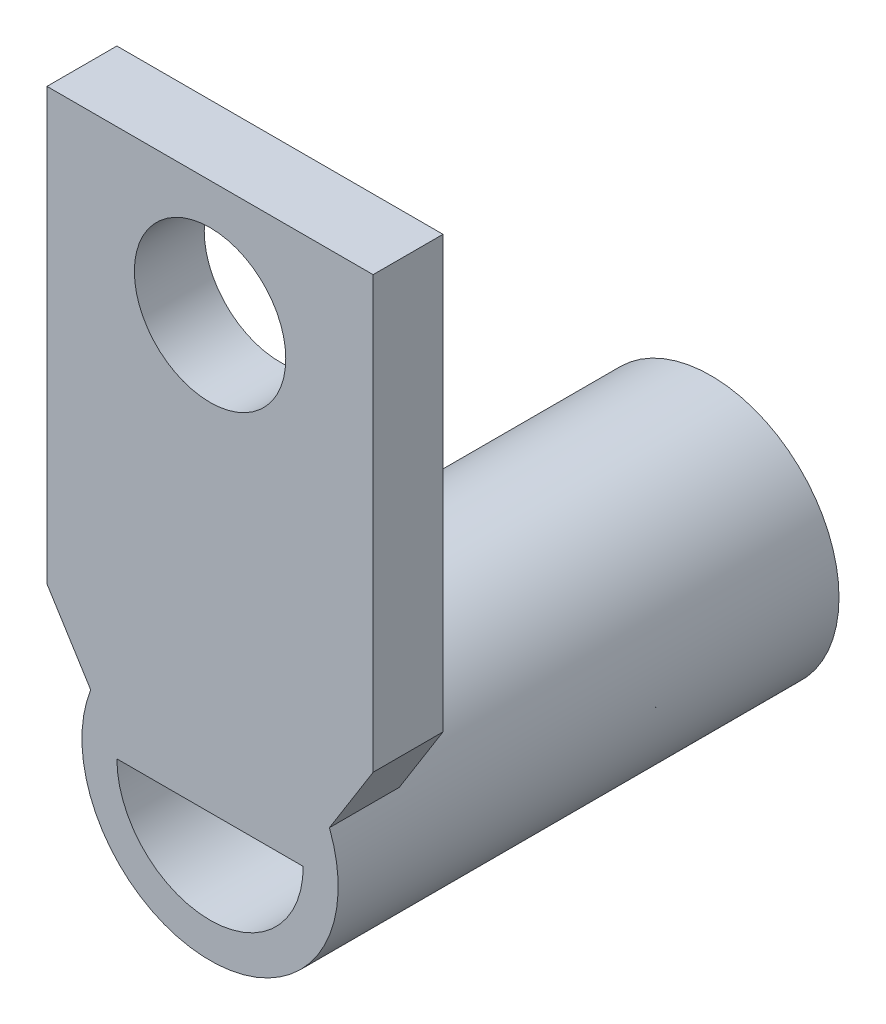
ISO-10303-21;
HEADER;
FILE_DESCRIPTION(('STEP AP214'),'2;1');
FILE_NAME('part.step','',(''),(''),'','','');
FILE_SCHEMA(('AUTOMOTIVE_DESIGN { 1 0 10303 214 1 1 1 1 }'));
ENDSEC;
DATA;
#1=APPLICATION_CONTEXT('core data for automotive mechanical design processes');
#2=APPLICATION_PROTOCOL_DEFINITION('international standard','automotive_design',2000,#1);
#3=PRODUCT_CONTEXT('',#1,'mechanical');
#4=PRODUCT('Part','Part','',(#3));
#5=PRODUCT_RELATED_PRODUCT_CATEGORY('part','',(#4));
#6=PRODUCT_DEFINITION_FORMATION('','',#4);
#7=PRODUCT_DEFINITION_CONTEXT('part definition',#1,'design');
#8=PRODUCT_DEFINITION('design','',#6,#7);
#9=PRODUCT_DEFINITION_SHAPE('','',#8);
#10=(LENGTH_UNIT() NAMED_UNIT(*) SI_UNIT(.MILLI.,.METRE.));
#11=(NAMED_UNIT(*) PLANE_ANGLE_UNIT() SI_UNIT($,.RADIAN.));
#12=(NAMED_UNIT(*) SI_UNIT($,.STERADIAN.) SOLID_ANGLE_UNIT());
#13=UNCERTAINTY_MEASURE_WITH_UNIT(LENGTH_MEASURE(1.E-05),#10,'distance_accuracy_value','');
#14=(GEOMETRIC_REPRESENTATION_CONTEXT(3) GLOBAL_UNCERTAINTY_ASSIGNED_CONTEXT((#13)) GLOBAL_UNIT_ASSIGNED_CONTEXT((#10,
#11,#12)) REPRESENTATION_CONTEXT('',''));
#15=CARTESIAN_POINT('',(0.,0.,0.));
#16=DIRECTION('',(0.,0.,1.));
#17=DIRECTION('',(1.,0.,0.));
#18=AXIS2_PLACEMENT_3D('',#15,#16,#17);
#19=CARTESIAN_POINT('',(0.,0.,21.5));
#20=DIRECTION('',(0.,0.,1.));
#21=DIRECTION('',(1.,0.,0.));
#22=AXIS2_PLACEMENT_3D('',#19,#20,#21);
#23=PLANE('',#22);
#24=DIRECTION('',(1.,0.,0.));
#25=VECTOR('',#24,1.);
#26=CARTESIAN_POINT('',(-7.,0.,21.5));
#27=LINE('',#26,#25);
#28=CARTESIAN_POINT('',(-3.99999999999999,0.,21.5));
#29=VERTEX_POINT('',#28);
#30=CARTESIAN_POINT('',(3.99999999999999,0.,21.5));
#31=VERTEX_POINT('',#30);
#32=EDGE_CURVE('E63',#29,#31,#27,.T.);
#33=ORIENTED_EDGE('',*,*,#32,.T.);
#34=CARTESIAN_POINT('',(0.,0.,21.5));
#35=DIRECTION('',(0.,0.,1.));
#36=DIRECTION('',(1.,0.,0.));
#37=AXIS2_PLACEMENT_3D('',#34,#35,#36);
#38=CIRCLE('',#37,3.99999999999999);
#39=EDGE_CURVE('E145',#29,#31,#38,.T.);
#40=ORIENTED_EDGE('',*,*,#39,.F.);
#41=EDGE_LOOP('',(#33,#40));
#42=FACE_BOUND('',#41,.T.);
#43=CARTESIAN_POINT('',(0.,0.,21.5));
#44=DIRECTION('',(0.,0.,1.));
#45=DIRECTION('',(1.,0.,0.));
#46=AXIS2_PLACEMENT_3D('',#43,#44,#45);
#47=CIRCLE('',#46,5.50000000000002);
#48=CARTESIAN_POINT('',(-5.12347538297982,2.,21.5));
#49=VERTEX_POINT('',#48);
#50=CARTESIAN_POINT('',(5.12347538297982,2.,21.5));
#51=VERTEX_POINT('',#50);
#52=EDGE_CURVE('E151',#49,#51,#47,.T.);
#53=ORIENTED_EDGE('',*,*,#52,.T.);
#54=DIRECTION('',(0.530308735896908,0.847804602860484,0.));
#55=VECTOR('',#54,1.);
#56=CARTESIAN_POINT('',(2.78341757626735,-1.74105053377078,21.5));
#57=LINE('',#56,#55);
#58=CARTESIAN_POINT('',(7.,5.,21.5));
#59=VERTEX_POINT('',#58);
#60=EDGE_CURVE('E179',#51,#59,#57,.T.);
#61=ORIENTED_EDGE('',*,*,#60,.T.);
#62=DIRECTION('',(0.,-1.,0.));
#63=VECTOR('',#62,1.);
#64=CARTESIAN_POINT('',(7.,23.5,21.5));
#65=LINE('',#64,#63);
#66=CARTESIAN_POINT('',(7.,23.5,21.5));
#67=VERTEX_POINT('',#66);
#68=EDGE_CURVE('E127',#67,#59,#65,.T.);
#69=ORIENTED_EDGE('',*,*,#68,.F.);
#70=DIRECTION('',(1.,0.,0.));
#71=VECTOR('',#70,1.);
#72=CARTESIAN_POINT('',(-7.,23.5,21.5));
#73=LINE('',#72,#71);
#74=CARTESIAN_POINT('',(-7.,23.5,21.5));
#75=VERTEX_POINT('',#74);
#76=EDGE_CURVE('E168',#75,#67,#73,.T.);
#77=ORIENTED_EDGE('',*,*,#76,.F.);
#78=DIRECTION('',(0.,-1.,0.));
#79=VECTOR('',#78,1.);
#80=CARTESIAN_POINT('',(-7.,23.5,21.5));
#81=LINE('',#80,#79);
#82=CARTESIAN_POINT('',(-7.,5.,21.5));
#83=VERTEX_POINT('',#82);
#84=EDGE_CURVE('E134',#75,#83,#81,.T.);
#85=ORIENTED_EDGE('',*,*,#84,.T.);
#86=DIRECTION('',(0.530308735896909,-0.847804602860484,0.));
#87=VECTOR('',#86,1.);
#88=CARTESIAN_POINT('',(-2.78341757626734,-1.74105053377078,21.5));
#89=LINE('',#88,#87);
#90=EDGE_CURVE('E181',#83,#49,#89,.T.);
#91=ORIENTED_EDGE('',*,*,#90,.T.);
#92=EDGE_LOOP('',(#53,#61,#69,#77,#85,#91));
#93=FACE_BOUND('',#92,.T.);
#94=CARTESIAN_POINT('',(0.,18.5,21.5));
#95=DIRECTION('',(0.,0.,1.));
#96=DIRECTION('',(1.,0.,0.));
#97=AXIS2_PLACEMENT_3D('',#94,#95,#96);
#98=CIRCLE('',#97,3.25);
#99=CARTESIAN_POINT('',(3.25,18.5,21.5));
#100=VERTEX_POINT('',#99);
#101=EDGE_CURVE('E170',#100,#100,#98,.T.);
#102=ORIENTED_EDGE('',*,*,#101,.F.);
#103=EDGE_LOOP('',(#102));
#104=FACE_BOUND('',#103,.T.);
#105=ADVANCED_FACE('F40',(#42,#93,#104),#23,.T.);
#106=CARTESIAN_POINT('',(-7.,23.5,18.5));
#107=DIRECTION('',(1.,0.,0.));
#108=DIRECTION('',(0.,0.,-1.));
#109=AXIS2_PLACEMENT_3D('',#106,#107,#108);
#110=PLANE('',#109);
#111=DIRECTION('',(0.,0.,-1.));
#112=VECTOR('',#111,1.);
#113=CARTESIAN_POINT('',(-7.,5.,28.5));
#114=LINE('',#113,#112);
#115=CARTESIAN_POINT('',(-7.,5.,18.5));
#116=VERTEX_POINT('',#115);
#117=EDGE_CURVE('E117',#83,#116,#114,.T.);
#118=ORIENTED_EDGE('',*,*,#117,.F.);
#119=ORIENTED_EDGE('',*,*,#84,.F.);
#120=DIRECTION('',(0.,0.,1.));
#121=VECTOR('',#120,1.);
#122=CARTESIAN_POINT('',(-7.,23.5,18.5));
#123=LINE('',#122,#121);
#124=CARTESIAN_POINT('',(-7.,23.5,18.5));
#125=VERTEX_POINT('',#124);
#126=EDGE_CURVE('E166',#125,#75,#123,.T.);
#127=ORIENTED_EDGE('',*,*,#126,.F.);
#128=DIRECTION('',(0.,-1.,0.));
#129=VECTOR('',#128,1.);
#130=CARTESIAN_POINT('',(-7.,23.5,18.5));
#131=LINE('',#130,#129);
#132=EDGE_CURVE('E132',#125,#116,#131,.T.);
#133=ORIENTED_EDGE('',*,*,#132,.T.);
#134=EDGE_LOOP('',(#118,#119,#127,#133));
#135=FACE_BOUND('',#134,.T.);
#136=ADVANCED_FACE('F202',(#135),#110,.F.);
#137=CARTESIAN_POINT('',(7.,23.5,18.5));
#138=DIRECTION('',(-1.,0.,0.));
#139=DIRECTION('',(0.,0.,1.));
#140=AXIS2_PLACEMENT_3D('',#137,#138,#139);
#141=PLANE('',#140);
#142=DIRECTION('',(0.,0.,-1.));
#143=VECTOR('',#142,1.);
#144=CARTESIAN_POINT('',(7.,5.,28.5));
#145=LINE('',#144,#143);
#146=CARTESIAN_POINT('',(7.,5.,18.5));
#147=VERTEX_POINT('',#146);
#148=EDGE_CURVE('E109',#59,#147,#145,.T.);
#149=ORIENTED_EDGE('',*,*,#148,.T.);
#150=DIRECTION('',(0.,-1.,0.));
#151=VECTOR('',#150,1.);
#152=CARTESIAN_POINT('',(7.,23.5,18.5));
#153=LINE('',#152,#151);
#154=CARTESIAN_POINT('',(7.,23.5,18.5));
#155=VERTEX_POINT('',#154);
#156=EDGE_CURVE('E124',#155,#147,#153,.T.);
#157=ORIENTED_EDGE('',*,*,#156,.F.);
#158=DIRECTION('',(0.,0.,-1.));
#159=VECTOR('',#158,1.);
#160=CARTESIAN_POINT('',(7.,23.5,18.5));
#161=LINE('',#160,#159);
#162=EDGE_CURVE('E174',#67,#155,#161,.T.);
#163=ORIENTED_EDGE('',*,*,#162,.F.);
#164=ORIENTED_EDGE('',*,*,#68,.T.);
#165=EDGE_LOOP('',(#149,#157,#163,#164));
#166=FACE_BOUND('',#165,.T.);
#167=ADVANCED_FACE('F122',(#166),#141,.F.);
#168=CARTESIAN_POINT('',(-7.,23.5,18.5));
#169=DIRECTION('',(0.,0.,1.));
#170=DIRECTION('',(1.,0.,0.));
#171=AXIS2_PLACEMENT_3D('',#168,#169,#170);
#172=PLANE('',#171);
#173=CARTESIAN_POINT('',(0.,18.5,18.5));
#174=DIRECTION('',(0.,0.,-1.));
#175=DIRECTION('',(-1.,0.,0.));
#176=AXIS2_PLACEMENT_3D('',#173,#174,#175);
#177=CIRCLE('',#176,3.25);
#178=CARTESIAN_POINT('',(-3.25,18.5,18.5));
#179=VERTEX_POINT('',#178);
#180=EDGE_CURVE('E184',#179,#179,#177,.T.);
#181=ORIENTED_EDGE('',*,*,#180,.F.);
#182=EDGE_LOOP('',(#181));
#183=FACE_BOUND('',#182,.T.);
#184=DIRECTION('',(-0.530308735896908,-0.847804602860484,0.));
#185=VECTOR('',#184,1.);
#186=CARTESIAN_POINT('',(2.78341757626735,-1.74105053377078,18.5));
#187=LINE('',#186,#185);
#188=CARTESIAN_POINT('',(5.12347538297982,2.,18.5));
#189=VERTEX_POINT('',#188);
#190=EDGE_CURVE('E105',#147,#189,#187,.T.);
#191=ORIENTED_EDGE('',*,*,#190,.T.);
#192=CARTESIAN_POINT('',(0.,0.,18.5));
#193=DIRECTION('',(0.,0.,1.));
#194=DIRECTION('',(1.,0.,0.));
#195=AXIS2_PLACEMENT_3D('',#192,#193,#194);
#196=CIRCLE('',#195,5.50000000000002);
#197=CARTESIAN_POINT('',(-5.12347538297982,2.,18.5));
#198=VERTEX_POINT('',#197);
#199=EDGE_CURVE('E142',#189,#198,#196,.T.);
#200=ORIENTED_EDGE('',*,*,#199,.T.);
#201=DIRECTION('',(-0.530308735896909,0.847804602860484,0.));
#202=VECTOR('',#201,1.);
#203=CARTESIAN_POINT('',(-2.78341757626734,-1.74105053377078,18.5));
#204=LINE('',#203,#202);
#205=EDGE_CURVE('E55',#198,#116,#204,.T.);
#206=ORIENTED_EDGE('',*,*,#205,.T.);
#207=ORIENTED_EDGE('',*,*,#132,.F.);
#208=DIRECTION('',(-1.,0.,0.));
#209=VECTOR('',#208,1.);
#210=CARTESIAN_POINT('',(-7.,23.5,18.5));
#211=LINE('',#210,#209);
#212=EDGE_CURVE('E131',#155,#125,#211,.T.);
#213=ORIENTED_EDGE('',*,*,#212,.F.);
#214=ORIENTED_EDGE('',*,*,#156,.T.);
#215=EDGE_LOOP('',(#191,#200,#206,#207,#213,#214));
#216=FACE_BOUND('',#215,.T.);
#217=ADVANCED_FACE('F129',(#183,#216),#172,.F.);
#218=CARTESIAN_POINT('',(0.,0.,21.5));
#219=DIRECTION('',(0.,0.,-1.));
#220=DIRECTION('',(-1.,0.,0.));
#221=AXIS2_PLACEMENT_3D('',#218,#219,#220);
#222=CYLINDRICAL_SURFACE('',#221,5.50000000000002);
#223=ORIENTED_EDGE('',*,*,#52,.F.);
#224=DIRECTION('',(0.,0.,-1.));
#225=VECTOR('',#224,1.);
#226=CARTESIAN_POINT('',(-5.12347538297982,2.,28.5));
#227=LINE('',#226,#225);
#228=EDGE_CURVE('E185',#49,#198,#227,.T.);
#229=ORIENTED_EDGE('',*,*,#228,.T.);
#230=ORIENTED_EDGE('',*,*,#199,.F.);
#231=DIRECTION('',(0.,0.,-1.));
#232=VECTOR('',#231,1.);
#233=CARTESIAN_POINT('',(5.12347538297982,2.,28.5));
#234=LINE('',#233,#232);
#235=EDGE_CURVE('E112',#51,#189,#234,.T.);
#236=ORIENTED_EDGE('',*,*,#235,.F.);
#237=EDGE_LOOP('',(#223,#229,#230,#236));
#238=FACE_BOUND('',#237,.T.);
#239=CARTESIAN_POINT('',(0.,0.,0.));
#240=DIRECTION('',(0.,0.,1.));
#241=DIRECTION('',(1.,0.,0.));
#242=AXIS2_PLACEMENT_3D('',#239,#240,#241);
#243=CIRCLE('',#242,5.50000000000002);
#244=CARTESIAN_POINT('',(5.50000000000002,0.,0.));
#245=VERTEX_POINT('',#244);
#246=EDGE_CURVE('E148',#245,#245,#243,.T.);
#247=ORIENTED_EDGE('',*,*,#246,.T.);
#248=EDGE_LOOP('',(#247));
#249=FACE_BOUND('',#248,.T.);
#250=ADVANCED_FACE('F42',(#238,#249),#222,.T.);
#251=CARTESIAN_POINT('',(0.,0.,21.5));
#252=DIRECTION('',(0.,0.,-1.));
#253=DIRECTION('',(-1.,0.,0.));
#254=AXIS2_PLACEMENT_3D('',#251,#252,#253);
#255=CYLINDRICAL_SURFACE('',#254,3.99999999999999);
#256=CARTESIAN_POINT('',(0.,0.,0.));
#257=DIRECTION('',(0.,0.,1.));
#258=DIRECTION('',(1.,0.,0.));
#259=AXIS2_PLACEMENT_3D('',#256,#257,#258);
#260=CIRCLE('',#259,3.99999999999999);
#261=CARTESIAN_POINT('',(3.99999999999999,0.,0.));
#262=VERTEX_POINT('',#261);
#263=EDGE_CURVE('E144',#262,#262,#260,.T.);
#264=ORIENTED_EDGE('',*,*,#263,.F.);
#265=EDGE_LOOP('',(#264));
#266=FACE_BOUND('',#265,.T.);
#267=ORIENTED_EDGE('',*,*,#39,.T.);
#268=DIRECTION('',(0.,0.,-1.));
#269=VECTOR('',#268,1.);
#270=CARTESIAN_POINT('',(3.99999999999999,0.,21.5));
#271=LINE('',#270,#269);
#272=CARTESIAN_POINT('',(3.99999999999999,0.,18.5));
#273=VERTEX_POINT('',#272);
#274=EDGE_CURVE('E11',#31,#273,#271,.T.);
#275=ORIENTED_EDGE('',*,*,#274,.T.);
#276=CARTESIAN_POINT('',(0.,0.,18.5));
#277=DIRECTION('',(0.,0.,1.));
#278=DIRECTION('',(1.,0.,0.));
#279=AXIS2_PLACEMENT_3D('',#276,#277,#278);
#280=CIRCLE('',#279,3.99999999999999);
#281=CARTESIAN_POINT('',(-3.99999999999999,0.,18.5));
#282=VERTEX_POINT('',#281);
#283=EDGE_CURVE('E48',#273,#282,#280,.T.);
#284=ORIENTED_EDGE('',*,*,#283,.T.);
#285=DIRECTION('',(0.,0.,-1.));
#286=VECTOR('',#285,1.);
#287=CARTESIAN_POINT('',(-3.99999999999999,0.,21.5));
#288=LINE('',#287,#286);
#289=EDGE_CURVE('E153',#282,#29,#288,.F.);
#290=ORIENTED_EDGE('',*,*,#289,.T.);
#291=EDGE_LOOP('',(#267,#275,#284,#290));
#292=FACE_BOUND('',#291,.T.);
#293=ADVANCED_FACE('F158',(#266,#292),#255,.F.);
#294=CARTESIAN_POINT('',(0.,0.,0.));
#295=DIRECTION('',(0.,0.,1.));
#296=DIRECTION('',(1.,0.,0.));
#297=AXIS2_PLACEMENT_3D('',#294,#295,#296);
#298=PLANE('',#297);
#299=ORIENTED_EDGE('',*,*,#246,.F.);
#300=EDGE_LOOP('',(#299));
#301=FACE_BOUND('',#300,.T.);
#302=ORIENTED_EDGE('',*,*,#263,.T.);
#303=EDGE_LOOP('',(#302));
#304=FACE_BOUND('',#303,.T.);
#305=ADVANCED_FACE('F217',(#301,#304),#298,.F.);
#306=CARTESIAN_POINT('',(0.,0.,0.));
#307=DIRECTION('',(0.,1.,0.));
#308=DIRECTION('',(0.,0.,1.));
#309=AXIS2_PLACEMENT_3D('',#306,#307,#308);
#310=PLANE('',#309);
#311=ORIENTED_EDGE('',*,*,#274,.F.);
#312=ORIENTED_EDGE('',*,*,#32,.F.);
#313=ORIENTED_EDGE('',*,*,#289,.F.);
#314=DIRECTION('',(-1.,0.,0.));
#315=VECTOR('',#314,1.);
#316=CARTESIAN_POINT('',(-7.,0.,18.5));
#317=LINE('',#316,#315);
#318=EDGE_CURVE('E164',#273,#282,#317,.T.);
#319=ORIENTED_EDGE('',*,*,#318,.F.);
#320=EDGE_LOOP('',(#311,#312,#313,#319));
#321=FACE_BOUND('',#320,.T.);
#322=ADVANCED_FACE('F165',(#321),#310,.F.);
#323=ORIENTED_EDGE('',*,*,#283,.F.);
#324=ORIENTED_EDGE('',*,*,#318,.T.);
#325=EDGE_LOOP('',(#323,#324));
#326=FACE_BOUND('',#325,.T.);
#327=ADVANCED_FACE('F163',(#326),#172,.F.);
#328=CARTESIAN_POINT('',(0.,23.5,0.));
#329=DIRECTION('',(0.,1.,0.));
#330=DIRECTION('',(0.,0.,1.));
#331=AXIS2_PLACEMENT_3D('',#328,#329,#330);
#332=PLANE('',#331);
#333=ORIENTED_EDGE('',*,*,#126,.T.);
#334=ORIENTED_EDGE('',*,*,#76,.T.);
#335=ORIENTED_EDGE('',*,*,#162,.T.);
#336=ORIENTED_EDGE('',*,*,#212,.T.);
#337=EDGE_LOOP('',(#333,#334,#335,#336));
#338=FACE_BOUND('',#337,.T.);
#339=ADVANCED_FACE('F206',(#338),#332,.T.);
#340=CARTESIAN_POINT('',(-2.78341757626734,-1.74105053377078,28.5));
#341=DIRECTION('',(-0.847804602860484,-0.530308735896909,0.));
#342=DIRECTION('',(0.530308735896909,-0.847804602860484,0.));
#343=AXIS2_PLACEMENT_3D('',#340,#341,#342);
#344=PLANE('',#343);
#345=ORIENTED_EDGE('',*,*,#117,.T.);
#346=ORIENTED_EDGE('',*,*,#205,.F.);
#347=ORIENTED_EDGE('',*,*,#228,.F.);
#348=ORIENTED_EDGE('',*,*,#90,.F.);
#349=EDGE_LOOP('',(#345,#346,#347,#348));
#350=FACE_BOUND('',#349,.T.);
#351=ADVANCED_FACE('F246',(#350),#344,.T.);
#352=CARTESIAN_POINT('',(2.78341757626735,-1.74105053377078,28.5));
#353=DIRECTION('',(0.847804602860484,-0.530308735896908,0.));
#354=DIRECTION('',(0.530308735896908,0.847804602860484,0.));
#355=AXIS2_PLACEMENT_3D('',#352,#353,#354);
#356=PLANE('',#355);
#357=ORIENTED_EDGE('',*,*,#235,.T.);
#358=ORIENTED_EDGE('',*,*,#190,.F.);
#359=ORIENTED_EDGE('',*,*,#148,.F.);
#360=ORIENTED_EDGE('',*,*,#60,.F.);
#361=EDGE_LOOP('',(#357,#358,#359,#360));
#362=FACE_BOUND('',#361,.T.);
#363=ADVANCED_FACE('F107',(#362),#356,.T.);
#364=CARTESIAN_POINT('',(0.,18.5,28.5));
#365=DIRECTION('',(0.,0.,-1.));
#366=DIRECTION('',(-1.,0.,0.));
#367=AXIS2_PLACEMENT_3D('',#364,#365,#366);
#368=CYLINDRICAL_SURFACE('',#367,3.25);
#369=ORIENTED_EDGE('',*,*,#101,.T.);
#370=EDGE_LOOP('',(#369));
#371=FACE_BOUND('',#370,.T.);
#372=ORIENTED_EDGE('',*,*,#180,.T.);
#373=EDGE_LOOP('',(#372));
#374=FACE_BOUND('',#373,.T.);
#375=ADVANCED_FACE('F193',(#371,#374),#368,.F.);
#376=CLOSED_SHELL('',(#105,#136,#167,#217,#250,#293,#305,#322,#327,#339,#351,#363,#375));
#377=MANIFOLD_SOLID_BREP('B2',#376);
#378=ADVANCED_BREP_SHAPE_REPRESENTATION('',(#18,#377),#14);
#379=SHAPE_DEFINITION_REPRESENTATION(#9,#378);
ENDSEC;
END-ISO-10303-21;
